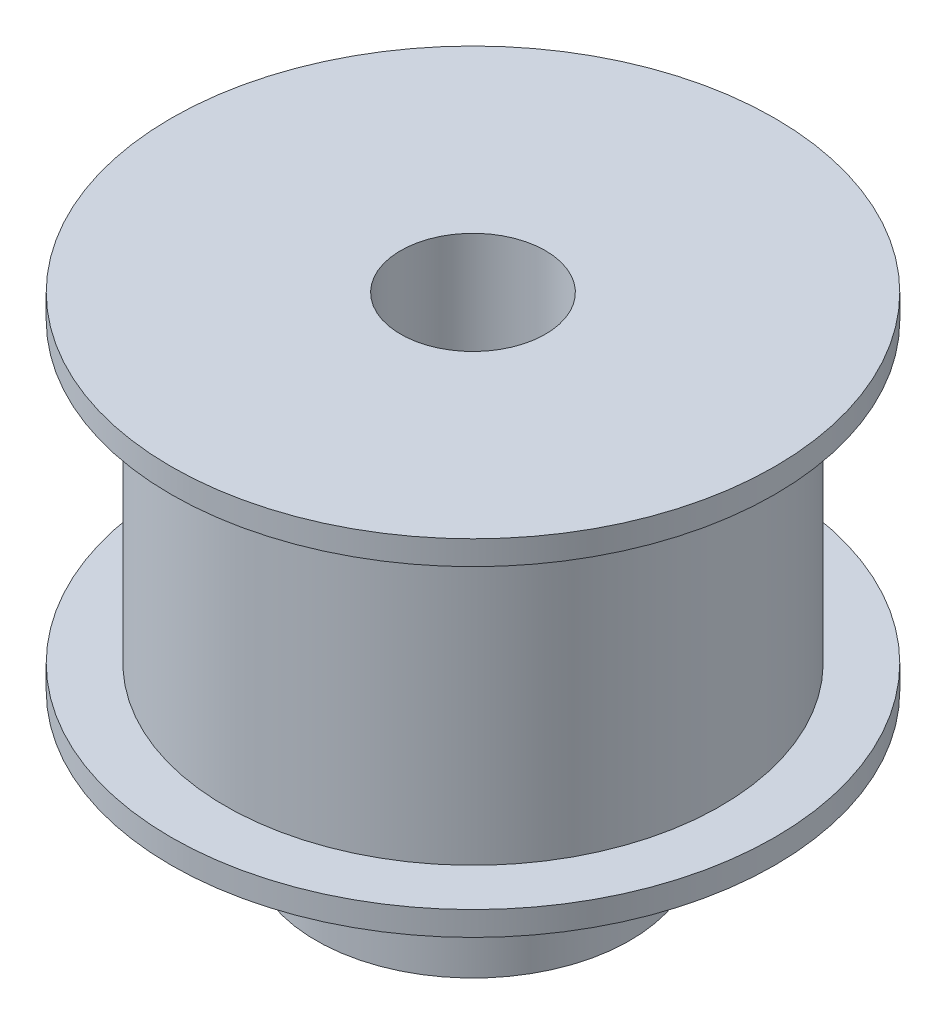
ISO-10303-21;
HEADER;
FILE_DESCRIPTION(('STEP AP214'),'2;1');
FILE_NAME('part.step','',(''),(''),'','','');
FILE_SCHEMA(('AUTOMOTIVE_DESIGN { 1 0 10303 214 1 1 1 1 }'));
ENDSEC;
DATA;
#1=APPLICATION_CONTEXT('core data for automotive mechanical design processes');
#2=APPLICATION_PROTOCOL_DEFINITION('international standard','automotive_design',2000,#1);
#3=PRODUCT_CONTEXT('',#1,'mechanical');
#4=PRODUCT('Part','Part','',(#3));
#5=PRODUCT_RELATED_PRODUCT_CATEGORY('part','',(#4));
#6=PRODUCT_DEFINITION_FORMATION('','',#4);
#7=PRODUCT_DEFINITION_CONTEXT('part definition',#1,'design');
#8=PRODUCT_DEFINITION('design','',#6,#7);
#9=PRODUCT_DEFINITION_SHAPE('','',#8);
#10=(LENGTH_UNIT() NAMED_UNIT(*) SI_UNIT(.MILLI.,.METRE.));
#11=(NAMED_UNIT(*) PLANE_ANGLE_UNIT() SI_UNIT($,.RADIAN.));
#12=(NAMED_UNIT(*) SI_UNIT($,.STERADIAN.) SOLID_ANGLE_UNIT());
#13=UNCERTAINTY_MEASURE_WITH_UNIT(LENGTH_MEASURE(1.E-05),#10,'distance_accuracy_value','');
#14=(GEOMETRIC_REPRESENTATION_CONTEXT(3) GLOBAL_UNCERTAINTY_ASSIGNED_CONTEXT((#13)) GLOBAL_UNIT_ASSIGNED_CONTEXT((#10,
#11,#12)) REPRESENTATION_CONTEXT('',''));
#15=CARTESIAN_POINT('',(0.,0.,0.));
#16=DIRECTION('',(0.,0.,1.));
#17=DIRECTION('',(1.,0.,0.));
#18=AXIS2_PLACEMENT_3D('',#15,#16,#17);
#19=CARTESIAN_POINT('',(6.5,0.,0.));
#20=DIRECTION('',(0.,-1.,0.));
#21=DIRECTION('',(0.,0.,-1.));
#22=AXIS2_PLACEMENT_3D('',#19,#20,#21);
#23=PLANE('',#22);
#24=CARTESIAN_POINT('',(0.,0.,0.));
#25=DIRECTION('',(0.,-1.,0.));
#26=DIRECTION('',(0.,0.,-1.));
#27=AXIS2_PLACEMENT_3D('',#24,#25,#26);
#28=CIRCLE('',#27,3.);
#29=CARTESIAN_POINT('',(0.,0.,-3.));
#30=VERTEX_POINT('',#29);
#31=EDGE_CURVE('E61',#30,#30,#28,.T.);
#32=ORIENTED_EDGE('',*,*,#31,.F.);
#33=EDGE_LOOP('',(#32));
#34=FACE_BOUND('',#33,.T.);
#35=CARTESIAN_POINT('',(0.,0.,0.));
#36=DIRECTION('',(0.,-1.,0.));
#37=DIRECTION('',(0.,0.,-1.));
#38=AXIS2_PLACEMENT_3D('',#35,#36,#37);
#39=CIRCLE('',#38,6.5);
#40=CARTESIAN_POINT('',(0.,0.,-6.5));
#41=VERTEX_POINT('',#40);
#42=EDGE_CURVE('E10',#41,#41,#39,.T.);
#43=ORIENTED_EDGE('',*,*,#42,.T.);
#44=EDGE_LOOP('',(#43));
#45=FACE_BOUND('',#44,.T.);
#46=ADVANCED_FACE('F29',(#34,#45),#23,.T.);
#47=CARTESIAN_POINT('',(0.,0.,0.));
#48=DIRECTION('',(0.,-1.,0.));
#49=DIRECTION('',(0.,0.,-1.));
#50=AXIS2_PLACEMENT_3D('',#47,#48,#49);
#51=CYLINDRICAL_SURFACE('',#50,6.5);
#52=CARTESIAN_POINT('',(0.,5.7,0.));
#53=DIRECTION('',(0.,-1.,0.));
#54=DIRECTION('',(0.,0.,-1.));
#55=AXIS2_PLACEMENT_3D('',#52,#53,#54);
#56=CIRCLE('',#55,6.5);
#57=CARTESIAN_POINT('',(0.,5.7,-6.5));
#58=VERTEX_POINT('',#57);
#59=EDGE_CURVE('E35',#58,#58,#56,.T.);
#60=ORIENTED_EDGE('',*,*,#59,.T.);
#61=EDGE_LOOP('',(#60));
#62=FACE_BOUND('',#61,.T.);
#63=ORIENTED_EDGE('',*,*,#42,.F.);
#64=EDGE_LOOP('',(#63));
#65=FACE_BOUND('',#64,.T.);
#66=ADVANCED_FACE('F77',(#62,#65),#51,.T.);
#67=CARTESIAN_POINT('',(6.5,5.7,0.));
#68=DIRECTION('',(0.,-1.,0.));
#69=DIRECTION('',(0.,0.,-1.));
#70=AXIS2_PLACEMENT_3D('',#67,#68,#69);
#71=PLANE('',#70);
#72=CARTESIAN_POINT('',(0.,5.7,0.));
#73=DIRECTION('',(0.,-1.,0.));
#74=DIRECTION('',(0.,0.,-1.));
#75=AXIS2_PLACEMENT_3D('',#72,#73,#74);
#76=CIRCLE('',#75,12.5);
#77=CARTESIAN_POINT('',(0.,5.7,-12.5));
#78=VERTEX_POINT('',#77);
#79=EDGE_CURVE('E39',#78,#78,#76,.T.);
#80=ORIENTED_EDGE('',*,*,#79,.T.);
#81=EDGE_LOOP('',(#80));
#82=FACE_BOUND('',#81,.T.);
#83=ORIENTED_EDGE('',*,*,#59,.F.);
#84=EDGE_LOOP('',(#83));
#85=FACE_BOUND('',#84,.T.);
#86=ADVANCED_FACE('F81',(#82,#85),#71,.T.);
#87=CARTESIAN_POINT('',(0.,0.,0.));
#88=DIRECTION('',(0.,-1.,0.));
#89=DIRECTION('',(0.,0.,-1.));
#90=AXIS2_PLACEMENT_3D('',#87,#88,#89);
#91=CYLINDRICAL_SURFACE('',#90,12.5);
#92=CARTESIAN_POINT('',(0.,6.7,0.));
#93=DIRECTION('',(0.,-1.,0.));
#94=DIRECTION('',(0.,0.,-1.));
#95=AXIS2_PLACEMENT_3D('',#92,#93,#94);
#96=CIRCLE('',#95,12.5);
#97=CARTESIAN_POINT('',(0.,6.7,-12.5));
#98=VERTEX_POINT('',#97);
#99=EDGE_CURVE('E43',#98,#98,#96,.T.);
#100=ORIENTED_EDGE('',*,*,#99,.T.);
#101=EDGE_LOOP('',(#100));
#102=FACE_BOUND('',#101,.T.);
#103=ORIENTED_EDGE('',*,*,#79,.F.);
#104=EDGE_LOOP('',(#103));
#105=FACE_BOUND('',#104,.T.);
#106=ADVANCED_FACE('F85',(#102,#105),#91,.T.);
#107=CARTESIAN_POINT('',(12.5,6.7,0.));
#108=DIRECTION('',(0.,1.,0.));
#109=DIRECTION('',(0.,0.,1.));
#110=AXIS2_PLACEMENT_3D('',#107,#108,#109);
#111=PLANE('',#110);
#112=CARTESIAN_POINT('',(0.,6.7,0.));
#113=DIRECTION('',(0.,-1.,0.));
#114=DIRECTION('',(0.,0.,-1.));
#115=AXIS2_PLACEMENT_3D('',#112,#113,#114);
#116=CIRCLE('',#115,10.255);
#117=CARTESIAN_POINT('',(0.,6.7,-10.255));
#118=VERTEX_POINT('',#117);
#119=EDGE_CURVE('E48',#118,#118,#116,.T.);
#120=ORIENTED_EDGE('',*,*,#119,.T.);
#121=EDGE_LOOP('',(#120));
#122=FACE_BOUND('',#121,.T.);
#123=ORIENTED_EDGE('',*,*,#99,.F.);
#124=EDGE_LOOP('',(#123));
#125=FACE_BOUND('',#124,.T.);
#126=ADVANCED_FACE('F92',(#122,#125),#111,.T.);
#127=CARTESIAN_POINT('',(0.,0.,0.));
#128=DIRECTION('',(0.,-1.,0.));
#129=DIRECTION('',(0.,0.,-1.));
#130=AXIS2_PLACEMENT_3D('',#127,#128,#129);
#131=CYLINDRICAL_SURFACE('',#130,10.255);
#132=CARTESIAN_POINT('',(0.,19.,0.));
#133=DIRECTION('',(0.,-1.,0.));
#134=DIRECTION('',(0.,0.,-1.));
#135=AXIS2_PLACEMENT_3D('',#132,#133,#134);
#136=CIRCLE('',#135,10.255);
#137=CARTESIAN_POINT('',(0.,19.,-10.255));
#138=VERTEX_POINT('',#137);
#139=EDGE_CURVE('E51',#138,#138,#136,.T.);
#140=ORIENTED_EDGE('',*,*,#139,.T.);
#141=EDGE_LOOP('',(#140));
#142=FACE_BOUND('',#141,.T.);
#143=ORIENTED_EDGE('',*,*,#119,.F.);
#144=EDGE_LOOP('',(#143));
#145=FACE_BOUND('',#144,.T.);
#146=ADVANCED_FACE('F96',(#142,#145),#131,.T.);
#147=CARTESIAN_POINT('',(10.255,19.,0.));
#148=DIRECTION('',(0.,-1.,0.));
#149=DIRECTION('',(0.,0.,-1.));
#150=AXIS2_PLACEMENT_3D('',#147,#148,#149);
#151=PLANE('',#150);
#152=CARTESIAN_POINT('',(0.,19.,0.));
#153=DIRECTION('',(0.,-1.,0.));
#154=DIRECTION('',(0.,0.,-1.));
#155=AXIS2_PLACEMENT_3D('',#152,#153,#154);
#156=CIRCLE('',#155,12.5);
#157=CARTESIAN_POINT('',(0.,19.,-12.5));
#158=VERTEX_POINT('',#157);
#159=EDGE_CURVE('E54',#158,#158,#156,.T.);
#160=ORIENTED_EDGE('',*,*,#159,.T.);
#161=EDGE_LOOP('',(#160));
#162=FACE_BOUND('',#161,.T.);
#163=ORIENTED_EDGE('',*,*,#139,.F.);
#164=EDGE_LOOP('',(#163));
#165=FACE_BOUND('',#164,.T.);
#166=ADVANCED_FACE('F100',(#162,#165),#151,.T.);
#167=CARTESIAN_POINT('',(0.,0.,0.));
#168=DIRECTION('',(0.,-1.,0.));
#169=DIRECTION('',(0.,0.,-1.));
#170=AXIS2_PLACEMENT_3D('',#167,#168,#169);
#171=CYLINDRICAL_SURFACE('',#170,12.5);
#172=CARTESIAN_POINT('',(0.,20.,0.));
#173=DIRECTION('',(0.,-1.,0.));
#174=DIRECTION('',(0.,0.,-1.));
#175=AXIS2_PLACEMENT_3D('',#172,#173,#174);
#176=CIRCLE('',#175,12.5);
#177=CARTESIAN_POINT('',(0.,20.,-12.5));
#178=VERTEX_POINT('',#177);
#179=EDGE_CURVE('E57',#178,#178,#176,.T.);
#180=ORIENTED_EDGE('',*,*,#179,.T.);
#181=EDGE_LOOP('',(#180));
#182=FACE_BOUND('',#181,.T.);
#183=ORIENTED_EDGE('',*,*,#159,.F.);
#184=EDGE_LOOP('',(#183));
#185=FACE_BOUND('',#184,.T.);
#186=ADVANCED_FACE('F104',(#182,#185),#171,.T.);
#187=CARTESIAN_POINT('',(12.5,20.,0.));
#188=DIRECTION('',(0.,1.,0.));
#189=DIRECTION('',(0.,0.,1.));
#190=AXIS2_PLACEMENT_3D('',#187,#188,#189);
#191=PLANE('',#190);
#192=CARTESIAN_POINT('',(0.,20.,0.));
#193=DIRECTION('',(0.,-1.,0.));
#194=DIRECTION('',(0.,0.,-1.));
#195=AXIS2_PLACEMENT_3D('',#192,#193,#194);
#196=CIRCLE('',#195,3.);
#197=CARTESIAN_POINT('',(0.,20.,-3.));
#198=VERTEX_POINT('',#197);
#199=EDGE_CURVE('E60',#198,#198,#196,.T.);
#200=ORIENTED_EDGE('',*,*,#199,.T.);
#201=EDGE_LOOP('',(#200));
#202=FACE_BOUND('',#201,.T.);
#203=ORIENTED_EDGE('',*,*,#179,.F.);
#204=EDGE_LOOP('',(#203));
#205=FACE_BOUND('',#204,.T.);
#206=ADVANCED_FACE('F67',(#202,#205),#191,.T.);
#207=CARTESIAN_POINT('',(0.,20.,0.));
#208=DIRECTION('',(0.,-1.,0.));
#209=DIRECTION('',(0.,0.,-1.));
#210=AXIS2_PLACEMENT_3D('',#207,#208,#209);
#211=CYLINDRICAL_SURFACE('',#210,3.);
#212=ORIENTED_EDGE('',*,*,#199,.F.);
#213=EDGE_LOOP('',(#212));
#214=FACE_BOUND('',#213,.T.);
#215=ORIENTED_EDGE('',*,*,#31,.T.);
#216=EDGE_LOOP('',(#215));
#217=FACE_BOUND('',#216,.T.);
#218=ADVANCED_FACE('F70',(#214,#217),#211,.F.);
#219=CLOSED_SHELL('',(#46,#66,#86,#106,#126,#146,#166,#186,#206,#218));
#220=MANIFOLD_SOLID_BREP('B2',#219);
#221=ADVANCED_BREP_SHAPE_REPRESENTATION('',(#18,#220),#14);
#222=SHAPE_DEFINITION_REPRESENTATION(#9,#221);
ENDSEC;
END-ISO-10303-21;
